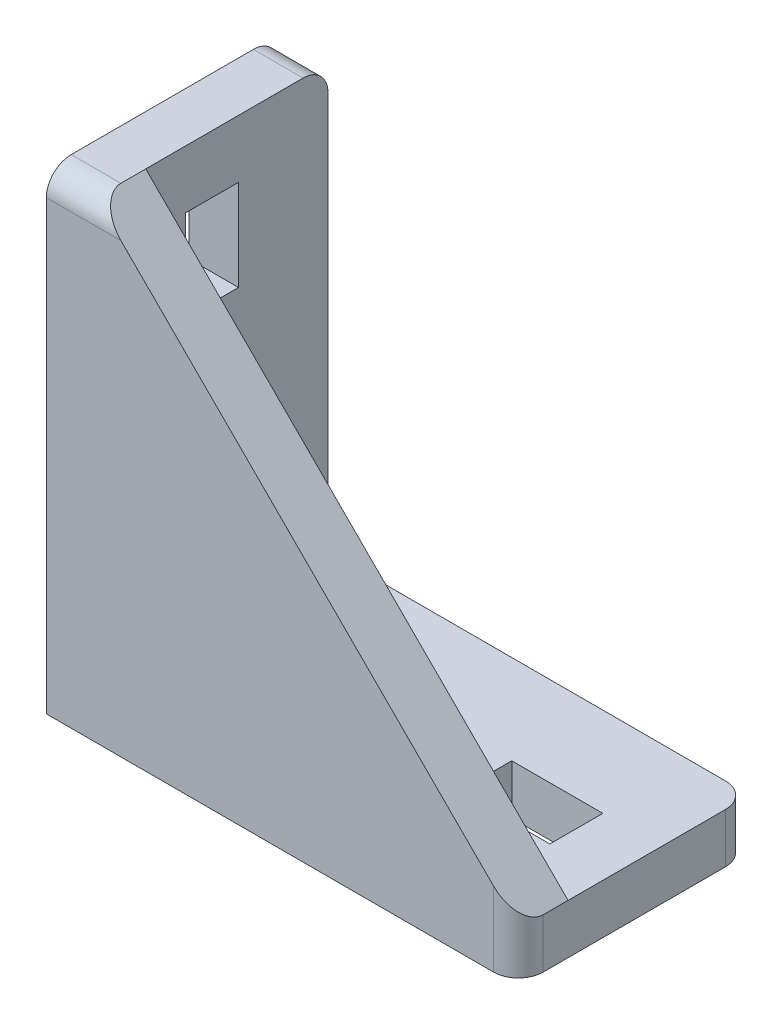
ISO-10303-21;
HEADER;
FILE_DESCRIPTION(('STEP AP214'),'2;1');
FILE_NAME('part.step','',(''),(''),'','','');
FILE_SCHEMA(('AUTOMOTIVE_DESIGN { 1 0 10303 214 1 1 1 1 }'));
ENDSEC;
DATA;
#1=APPLICATION_CONTEXT('core data for automotive mechanical design processes');
#2=APPLICATION_PROTOCOL_DEFINITION('international standard','automotive_design',2000,#1);
#3=PRODUCT_CONTEXT('',#1,'mechanical');
#4=PRODUCT('Part','Part','',(#3));
#5=PRODUCT_RELATED_PRODUCT_CATEGORY('part','',(#4));
#6=PRODUCT_DEFINITION_FORMATION('','',#4);
#7=PRODUCT_DEFINITION_CONTEXT('part definition',#1,'design');
#8=PRODUCT_DEFINITION('design','',#6,#7);
#9=PRODUCT_DEFINITION_SHAPE('','',#8);
#10=(LENGTH_UNIT() NAMED_UNIT(*) SI_UNIT(.MILLI.,.METRE.));
#11=(NAMED_UNIT(*) PLANE_ANGLE_UNIT() SI_UNIT($,.RADIAN.));
#12=(NAMED_UNIT(*) SI_UNIT($,.STERADIAN.) SOLID_ANGLE_UNIT());
#13=UNCERTAINTY_MEASURE_WITH_UNIT(LENGTH_MEASURE(1.E-05),#10,'distance_accuracy_value','');
#14=(GEOMETRIC_REPRESENTATION_CONTEXT(3) GLOBAL_UNCERTAINTY_ASSIGNED_CONTEXT((#13)) GLOBAL_UNIT_ASSIGNED_CONTEXT((#10,
#11,#12)) REPRESENTATION_CONTEXT('',''));
#15=CARTESIAN_POINT('',(0.,0.,0.));
#16=DIRECTION('',(0.,0.,1.));
#17=DIRECTION('',(1.,0.,0.));
#18=AXIS2_PLACEMENT_3D('',#15,#16,#17);
#19=CARTESIAN_POINT('',(6.00000000000001,6.,28.));
#20=DIRECTION('',(0.,-1.,0.));
#21=DIRECTION('',(0.,0.,-1.));
#22=AXIS2_PLACEMENT_3D('',#19,#20,#21);
#23=PLANE('',#22);
#24=DIRECTION('',(-1.,0.,0.));
#25=VECTOR('',#24,1.);
#26=CARTESIAN_POINT('',(39.,6.,10.8));
#27=LINE('',#26,#25);
#28=CARTESIAN_POINT('',(50.,6.,10.8));
#29=VERTEX_POINT('',#28);
#30=CARTESIAN_POINT('',(39.,6.,10.8));
#31=VERTEX_POINT('',#30);
#32=EDGE_CURVE('E245',#29,#31,#27,.T.);
#33=ORIENTED_EDGE('',*,*,#32,.F.);
#34=DIRECTION('',(0.,0.,-1.));
#35=VECTOR('',#34,1.);
#36=CARTESIAN_POINT('',(50.,6.,10.8));
#37=LINE('',#36,#35);
#38=CARTESIAN_POINT('',(50.,6.,17.2));
#39=VERTEX_POINT('',#38);
#40=EDGE_CURVE('E218',#39,#29,#37,.T.);
#41=ORIENTED_EDGE('',*,*,#40,.F.);
#42=DIRECTION('',(1.,0.,0.));
#43=VECTOR('',#42,1.);
#44=CARTESIAN_POINT('',(39.,6.,17.2));
#45=LINE('',#44,#43);
#46=CARTESIAN_POINT('',(39.,6.,17.2));
#47=VERTEX_POINT('',#46);
#48=EDGE_CURVE('E236',#47,#39,#45,.T.);
#49=ORIENTED_EDGE('',*,*,#48,.F.);
#50=DIRECTION('',(0.,0.,1.));
#51=VECTOR('',#50,1.);
#52=CARTESIAN_POINT('',(39.,6.,10.8));
#53=LINE('',#52,#51);
#54=EDGE_CURVE('E239',#31,#47,#53,.T.);
#55=ORIENTED_EDGE('',*,*,#54,.F.);
#56=EDGE_LOOP('',(#33,#41,#49,#55));
#57=FACE_BOUND('',#56,.T.);
#58=DIRECTION('',(-1.,0.,0.));
#59=VECTOR('',#58,1.);
#60=CARTESIAN_POINT('',(10.,6.,10.8));
#61=LINE('',#60,#59);
#62=CARTESIAN_POINT('',(20.,6.,10.8));
#63=VERTEX_POINT('',#62);
#64=CARTESIAN_POINT('',(10.,6.,10.8));
#65=VERTEX_POINT('',#64);
#66=EDGE_CURVE('E272',#63,#65,#61,.T.);
#67=ORIENTED_EDGE('',*,*,#66,.F.);
#68=DIRECTION('',(0.,0.,-1.));
#69=VECTOR('',#68,1.);
#70=CARTESIAN_POINT('',(20.,6.,10.8));
#71=LINE('',#70,#69);
#72=CARTESIAN_POINT('',(20.,6.,17.2));
#73=VERTEX_POINT('',#72);
#74=EDGE_CURVE('E270',#73,#63,#71,.T.);
#75=ORIENTED_EDGE('',*,*,#74,.F.);
#76=DIRECTION('',(1.,0.,0.));
#77=VECTOR('',#76,1.);
#78=CARTESIAN_POINT('',(10.,6.,17.2));
#79=LINE('',#78,#77);
#80=CARTESIAN_POINT('',(10.,6.,17.2));
#81=VERTEX_POINT('',#80);
#82=EDGE_CURVE('E260',#81,#73,#79,.T.);
#83=ORIENTED_EDGE('',*,*,#82,.F.);
#84=DIRECTION('',(0.,0.,1.));
#85=VECTOR('',#84,1.);
#86=CARTESIAN_POINT('',(10.,6.,10.8));
#87=LINE('',#86,#85);
#88=EDGE_CURVE('E275',#65,#81,#87,.T.);
#89=ORIENTED_EDGE('',*,*,#88,.F.);
#90=EDGE_LOOP('',(#67,#75,#83,#89));
#91=FACE_BOUND('',#90,.T.);
#92=DIRECTION('',(0.,0.,-1.));
#93=VECTOR('',#92,1.);
#94=CARTESIAN_POINT('',(57.,6.,28.));
#95=LINE('',#94,#93);
#96=CARTESIAN_POINT('',(57.,6.,22.));
#97=VERTEX_POINT('',#96);
#98=CARTESIAN_POINT('',(57.,6.,3.));
#99=VERTEX_POINT('',#98);
#100=EDGE_CURVE('E388',#97,#99,#95,.T.);
#101=ORIENTED_EDGE('',*,*,#100,.T.);
#102=CARTESIAN_POINT('',(54.,6.,3.));
#103=DIRECTION('',(0.,-1.,0.));
#104=DIRECTION('',(0.,0.,-1.));
#105=AXIS2_PLACEMENT_3D('',#102,#103,#104);
#106=CIRCLE('',#105,3.);
#107=CARTESIAN_POINT('',(54.,6.,0.));
#108=VERTEX_POINT('',#107);
#109=EDGE_CURVE('E11',#99,#108,#106,.F.);
#110=ORIENTED_EDGE('',*,*,#109,.T.);
#111=DIRECTION('',(-1.,0.,0.));
#112=VECTOR('',#111,1.);
#113=CARTESIAN_POINT('',(6.00000000000001,6.,0.));
#114=LINE('',#113,#112);
#115=CARTESIAN_POINT('',(6.00000000000001,6.,0.));
#116=VERTEX_POINT('',#115);
#117=EDGE_CURVE('E372',#108,#116,#114,.T.);
#118=ORIENTED_EDGE('',*,*,#117,.T.);
#119=DIRECTION('',(0.,0.,-1.));
#120=VECTOR('',#119,1.);
#121=CARTESIAN_POINT('',(6.00000000000001,6.,28.));
#122=LINE('',#121,#120);
#123=CARTESIAN_POINT('',(6.00000000000001,6.,22.));
#124=VERTEX_POINT('',#123);
#125=EDGE_CURVE('E385',#124,#116,#122,.T.);
#126=ORIENTED_EDGE('',*,*,#125,.F.);
#127=DIRECTION('',(1.,0.,0.));
#128=VECTOR('',#127,1.);
#129=CARTESIAN_POINT('',(6.00000000000001,6.,22.));
#130=LINE('',#129,#128);
#131=EDGE_CURVE('E357',#124,#97,#130,.T.);
#132=ORIENTED_EDGE('',*,*,#131,.T.);
#133=EDGE_LOOP('',(#101,#110,#118,#126,#132));
#134=FACE_BOUND('',#133,.T.);
#135=ADVANCED_FACE('F32',(#57,#91,#134),#23,.F.);
#136=CARTESIAN_POINT('',(6.,57.,28.));
#137=DIRECTION('',(-1.,0.,0.));
#138=DIRECTION('',(0.,-1.,0.));
#139=AXIS2_PLACEMENT_3D('',#136,#137,#138);
#140=PLANE('',#139);
#141=DIRECTION('',(0.,0.,1.));
#142=VECTOR('',#141,1.);
#143=CARTESIAN_POINT('',(6.,50.,17.2));
#144=LINE('',#143,#142);
#145=CARTESIAN_POINT('',(6.,50.,10.8));
#146=VERTEX_POINT('',#145);
#147=CARTESIAN_POINT('',(6.,50.,17.2));
#148=VERTEX_POINT('',#147);
#149=EDGE_CURVE('E303',#146,#148,#144,.T.);
#150=ORIENTED_EDGE('',*,*,#149,.F.);
#151=DIRECTION('',(0.,1.,0.));
#152=VECTOR('',#151,1.);
#153=CARTESIAN_POINT('',(6.,39.,10.8));
#154=LINE('',#153,#152);
#155=CARTESIAN_POINT('',(6.,39.,10.8));
#156=VERTEX_POINT('',#155);
#157=EDGE_CURVE('E301',#156,#146,#154,.T.);
#158=ORIENTED_EDGE('',*,*,#157,.F.);
#159=DIRECTION('',(0.,0.,-1.));
#160=VECTOR('',#159,1.);
#161=CARTESIAN_POINT('',(6.,39.,17.2));
#162=LINE('',#161,#160);
#163=CARTESIAN_POINT('',(6.,39.,17.2));
#164=VERTEX_POINT('',#163);
#165=EDGE_CURVE('E291',#164,#156,#162,.T.);
#166=ORIENTED_EDGE('',*,*,#165,.F.);
#167=DIRECTION('',(0.,-1.,0.));
#168=VECTOR('',#167,1.);
#169=CARTESIAN_POINT('',(6.,39.,17.2));
#170=LINE('',#169,#168);
#171=EDGE_CURVE('E307',#148,#164,#170,.T.);
#172=ORIENTED_EDGE('',*,*,#171,.F.);
#173=EDGE_LOOP('',(#150,#158,#166,#172));
#174=FACE_BOUND('',#173,.T.);
#175=DIRECTION('',(0.,0.,1.));
#176=VECTOR('',#175,1.);
#177=CARTESIAN_POINT('',(6.,20.,17.2));
#178=LINE('',#177,#176);
#179=CARTESIAN_POINT('',(6.,20.,10.8));
#180=VERTEX_POINT('',#179);
#181=CARTESIAN_POINT('',(6.,20.,17.2));
#182=VERTEX_POINT('',#181);
#183=EDGE_CURVE('E336',#180,#182,#178,.T.);
#184=ORIENTED_EDGE('',*,*,#183,.F.);
#185=DIRECTION('',(0.,1.,0.));
#186=VECTOR('',#185,1.);
#187=CARTESIAN_POINT('',(6.00000000000001,9.99999999999999,10.8));
#188=LINE('',#187,#186);
#189=CARTESIAN_POINT('',(6.00000000000001,9.99999999999999,10.8));
#190=VERTEX_POINT('',#189);
#191=EDGE_CURVE('E252',#190,#180,#188,.T.);
#192=ORIENTED_EDGE('',*,*,#191,.F.);
#193=DIRECTION('',(0.,0.,-1.));
#194=VECTOR('',#193,1.);
#195=CARTESIAN_POINT('',(6.00000000000001,9.99999999999999,17.2));
#196=LINE('',#195,#194);
#197=CARTESIAN_POINT('',(6.00000000000001,9.99999999999999,17.2));
#198=VERTEX_POINT('',#197);
#199=EDGE_CURVE('E325',#198,#190,#196,.T.);
#200=ORIENTED_EDGE('',*,*,#199,.F.);
#201=DIRECTION('',(0.,-1.,0.));
#202=VECTOR('',#201,1.);
#203=CARTESIAN_POINT('',(6.00000000000001,9.99999999999999,17.2));
#204=LINE('',#203,#202);
#205=EDGE_CURVE('E339',#182,#198,#204,.T.);
#206=ORIENTED_EDGE('',*,*,#205,.F.);
#207=EDGE_LOOP('',(#184,#192,#200,#206));
#208=FACE_BOUND('',#207,.T.);
#209=DIRECTION('',(0.,1.,0.));
#210=VECTOR('',#209,1.);
#211=CARTESIAN_POINT('',(6.,57.,0.));
#212=LINE('',#211,#210);
#213=CARTESIAN_POINT('',(6.,54.,0.));
#214=VERTEX_POINT('',#213);
#215=EDGE_CURVE('E374',#116,#214,#212,.T.);
#216=ORIENTED_EDGE('',*,*,#215,.T.);
#217=CARTESIAN_POINT('',(6.,54.,3.));
#218=DIRECTION('',(-1.,0.,0.));
#219=DIRECTION('',(0.,-1.,0.));
#220=AXIS2_PLACEMENT_3D('',#217,#218,#219);
#221=CIRCLE('',#220,3.);
#222=CARTESIAN_POINT('',(6.,57.,3.));
#223=VERTEX_POINT('',#222);
#224=EDGE_CURVE('E40',#214,#223,#221,.F.);
#225=ORIENTED_EDGE('',*,*,#224,.T.);
#226=DIRECTION('',(0.,0.,-1.));
#227=VECTOR('',#226,1.);
#228=CARTESIAN_POINT('',(6.,57.,28.));
#229=LINE('',#228,#227);
#230=CARTESIAN_POINT('',(6.,57.,22.));
#231=VERTEX_POINT('',#230);
#232=EDGE_CURVE('E382',#231,#223,#229,.T.);
#233=ORIENTED_EDGE('',*,*,#232,.F.);
#234=DIRECTION('',(0.,-1.,0.));
#235=VECTOR('',#234,1.);
#236=CARTESIAN_POINT('',(6.,57.,22.));
#237=LINE('',#236,#235);
#238=EDGE_CURVE('E354',#231,#124,#237,.T.);
#239=ORIENTED_EDGE('',*,*,#238,.T.);
#240=ORIENTED_EDGE('',*,*,#125,.T.);
#241=EDGE_LOOP('',(#216,#225,#233,#239,#240));
#242=FACE_BOUND('',#241,.T.);
#243=ADVANCED_FACE('F428',(#174,#208,#242),#140,.F.);
#244=CARTESIAN_POINT('',(57.,0.,28.));
#245=DIRECTION('',(0.,1.,0.));
#246=DIRECTION('',(0.,0.,1.));
#247=AXIS2_PLACEMENT_3D('',#244,#245,#246);
#248=PLANE('',#247);
#249=DIRECTION('',(1.,0.,0.));
#250=VECTOR('',#249,1.);
#251=CARTESIAN_POINT('',(39.,0.,17.2));
#252=LINE('',#251,#250);
#253=CARTESIAN_POINT('',(39.,0.,17.2));
#254=VERTEX_POINT('',#253);
#255=CARTESIAN_POINT('',(50.,0.,17.2));
#256=VERTEX_POINT('',#255);
#257=EDGE_CURVE('E223',#254,#256,#252,.T.);
#258=ORIENTED_EDGE('',*,*,#257,.T.);
#259=DIRECTION('',(0.,0.,-1.));
#260=VECTOR('',#259,1.);
#261=CARTESIAN_POINT('',(50.,0.,10.8));
#262=LINE('',#261,#260);
#263=CARTESIAN_POINT('',(50.,0.,10.8));
#264=VERTEX_POINT('',#263);
#265=EDGE_CURVE('E215',#256,#264,#262,.T.);
#266=ORIENTED_EDGE('',*,*,#265,.T.);
#267=DIRECTION('',(-1.,0.,0.));
#268=VECTOR('',#267,1.);
#269=CARTESIAN_POINT('',(39.,0.,10.8));
#270=LINE('',#269,#268);
#271=CARTESIAN_POINT('',(39.,0.,10.8));
#272=VERTEX_POINT('',#271);
#273=EDGE_CURVE('E227',#264,#272,#270,.T.);
#274=ORIENTED_EDGE('',*,*,#273,.T.);
#275=DIRECTION('',(0.,0.,1.));
#276=VECTOR('',#275,1.);
#277=CARTESIAN_POINT('',(39.,0.,10.8));
#278=LINE('',#277,#276);
#279=EDGE_CURVE('E231',#272,#254,#278,.T.);
#280=ORIENTED_EDGE('',*,*,#279,.T.);
#281=EDGE_LOOP('',(#258,#266,#274,#280));
#282=FACE_BOUND('',#281,.T.);
#283=DIRECTION('',(1.,0.,0.));
#284=VECTOR('',#283,1.);
#285=CARTESIAN_POINT('',(10.,0.,17.2));
#286=LINE('',#285,#284);
#287=CARTESIAN_POINT('',(10.,0.,17.2));
#288=VERTEX_POINT('',#287);
#289=CARTESIAN_POINT('',(20.,0.,17.2));
#290=VERTEX_POINT('',#289);
#291=EDGE_CURVE('E266',#288,#290,#286,.T.);
#292=ORIENTED_EDGE('',*,*,#291,.T.);
#293=DIRECTION('',(0.,0.,-1.));
#294=VECTOR('',#293,1.);
#295=CARTESIAN_POINT('',(20.,0.,10.8));
#296=LINE('',#295,#294);
#297=CARTESIAN_POINT('',(20.,0.,10.8));
#298=VERTEX_POINT('',#297);
#299=EDGE_CURVE('E256',#290,#298,#296,.T.);
#300=ORIENTED_EDGE('',*,*,#299,.T.);
#301=DIRECTION('',(-1.,0.,0.));
#302=VECTOR('',#301,1.);
#303=CARTESIAN_POINT('',(10.,0.,10.8));
#304=LINE('',#303,#302);
#305=CARTESIAN_POINT('',(10.,0.,10.8));
#306=VERTEX_POINT('',#305);
#307=EDGE_CURVE('E259',#298,#306,#304,.T.);
#308=ORIENTED_EDGE('',*,*,#307,.T.);
#309=DIRECTION('',(0.,0.,1.));
#310=VECTOR('',#309,1.);
#311=CARTESIAN_POINT('',(10.,0.,10.8));
#312=LINE('',#311,#310);
#313=EDGE_CURVE('E263',#306,#288,#312,.T.);
#314=ORIENTED_EDGE('',*,*,#313,.T.);
#315=EDGE_LOOP('',(#292,#300,#308,#314));
#316=FACE_BOUND('',#315,.T.);
#317=DIRECTION('',(0.,0.,-1.));
#318=VECTOR('',#317,1.);
#319=CARTESIAN_POINT('',(57.,0.,28.));
#320=LINE('',#319,#318);
#321=CARTESIAN_POINT('',(57.,0.,25.));
#322=VERTEX_POINT('',#321);
#323=CARTESIAN_POINT('',(57.,0.,3.));
#324=VERTEX_POINT('',#323);
#325=EDGE_CURVE('E391',#322,#324,#320,.T.);
#326=ORIENTED_EDGE('',*,*,#325,.F.);
#327=CARTESIAN_POINT('',(54.,0.,25.));
#328=DIRECTION('',(0.,1.,0.));
#329=DIRECTION('',(0.,0.,1.));
#330=AXIS2_PLACEMENT_3D('',#327,#328,#329);
#331=CIRCLE('',#330,3.);
#332=CARTESIAN_POINT('',(54.,0.,28.));
#333=VERTEX_POINT('',#332);
#334=EDGE_CURVE('E411',#322,#333,#331,.F.);
#335=ORIENTED_EDGE('',*,*,#334,.T.);
#336=DIRECTION('',(1.,0.,0.));
#337=VECTOR('',#336,1.);
#338=CARTESIAN_POINT('',(57.,0.,28.));
#339=LINE('',#338,#337);
#340=CARTESIAN_POINT('',(0.,0.,28.));
#341=VERTEX_POINT('',#340);
#342=EDGE_CURVE('E363',#341,#333,#339,.T.);
#343=ORIENTED_EDGE('',*,*,#342,.F.);
#344=DIRECTION('',(0.,0.,-1.));
#345=VECTOR('',#344,1.);
#346=CARTESIAN_POINT('',(0.,0.,28.));
#347=LINE('',#346,#345);
#348=CARTESIAN_POINT('',(0.,0.,0.));
#349=VERTEX_POINT('',#348);
#350=EDGE_CURVE('E369',#341,#349,#347,.T.);
#351=ORIENTED_EDGE('',*,*,#350,.T.);
#352=DIRECTION('',(1.,0.,0.));
#353=VECTOR('',#352,1.);
#354=CARTESIAN_POINT('',(57.,0.,0.));
#355=LINE('',#354,#353);
#356=CARTESIAN_POINT('',(54.,0.,0.));
#357=VERTEX_POINT('',#356);
#358=EDGE_CURVE('E360',#349,#357,#355,.T.);
#359=ORIENTED_EDGE('',*,*,#358,.T.);
#360=CARTESIAN_POINT('',(54.,0.,3.));
#361=DIRECTION('',(0.,1.,0.));
#362=DIRECTION('',(0.,0.,1.));
#363=AXIS2_PLACEMENT_3D('',#360,#361,#362);
#364=CIRCLE('',#363,3.);
#365=EDGE_CURVE('E409',#357,#324,#364,.F.);
#366=ORIENTED_EDGE('',*,*,#365,.T.);
#367=EDGE_LOOP('',(#326,#335,#343,#351,#359,#366));
#368=FACE_BOUND('',#367,.T.);
#369=ADVANCED_FACE('F233',(#282,#316,#368),#248,.F.);
#370=CARTESIAN_POINT('',(57.,6.,28.));
#371=DIRECTION('',(-1.,0.,0.));
#372=DIRECTION('',(0.,-1.,0.));
#373=AXIS2_PLACEMENT_3D('',#370,#371,#372);
#374=PLANE('',#373);
#375=CARTESIAN_POINT('',(57.,6.,25.));
#376=VERTEX_POINT('',#375);
#377=EDGE_CURVE('E389',#376,#97,#95,.T.);
#378=ORIENTED_EDGE('',*,*,#377,.F.);
#379=DIRECTION('',(0.,1.,0.));
#380=VECTOR('',#379,1.);
#381=CARTESIAN_POINT('',(57.,6.,25.));
#382=LINE('',#381,#380);
#383=EDGE_CURVE('E407',#376,#322,#382,.F.);
#384=ORIENTED_EDGE('',*,*,#383,.T.);
#385=ORIENTED_EDGE('',*,*,#325,.T.);
#386=DIRECTION('',(0.,1.,0.));
#387=VECTOR('',#386,1.);
#388=CARTESIAN_POINT('',(57.,6.,3.));
#389=LINE('',#388,#387);
#390=EDGE_CURVE('E404',#324,#99,#389,.T.);
#391=ORIENTED_EDGE('',*,*,#390,.T.);
#392=ORIENTED_EDGE('',*,*,#100,.F.);
#393=EDGE_LOOP('',(#378,#384,#385,#391,#392));
#394=FACE_BOUND('',#393,.T.);
#395=ADVANCED_FACE('F453',(#394),#374,.F.);
#396=CARTESIAN_POINT('',(0.,57.,28.));
#397=DIRECTION('',(0.,-1.,0.));
#398=DIRECTION('',(0.,0.,-1.));
#399=AXIS2_PLACEMENT_3D('',#396,#397,#398);
#400=PLANE('',#399);
#401=DIRECTION('',(0.,0.,-1.));
#402=VECTOR('',#401,1.);
#403=CARTESIAN_POINT('',(0.,57.,28.));
#404=LINE('',#403,#402);
#405=CARTESIAN_POINT('',(0.,57.,25.));
#406=VERTEX_POINT('',#405);
#407=CARTESIAN_POINT('',(0.,57.,3.));
#408=VERTEX_POINT('',#407);
#409=EDGE_CURVE('E379',#406,#408,#404,.T.);
#410=ORIENTED_EDGE('',*,*,#409,.F.);
#411=DIRECTION('',(-1.,0.,0.));
#412=VECTOR('',#411,1.);
#413=CARTESIAN_POINT('',(0.,57.,25.));
#414=LINE('',#413,#412);
#415=CARTESIAN_POINT('',(6.,57.,25.));
#416=VERTEX_POINT('',#415);
#417=EDGE_CURVE('E420',#406,#416,#414,.F.);
#418=ORIENTED_EDGE('',*,*,#417,.T.);
#419=EDGE_CURVE('E383',#416,#231,#229,.T.);
#420=ORIENTED_EDGE('',*,*,#419,.T.);
#421=ORIENTED_EDGE('',*,*,#232,.T.);
#422=DIRECTION('',(-1.,0.,0.));
#423=VECTOR('',#422,1.);
#424=CARTESIAN_POINT('',(0.,57.,3.));
#425=LINE('',#424,#423);
#426=EDGE_CURVE('E417',#223,#408,#425,.T.);
#427=ORIENTED_EDGE('',*,*,#426,.T.);
#428=EDGE_LOOP('',(#410,#418,#420,#421,#427));
#429=FACE_BOUND('',#428,.T.);
#430=ADVANCED_FACE('F433',(#429),#400,.F.);
#431=CARTESIAN_POINT('',(0.,0.,28.));
#432=DIRECTION('',(1.,0.,0.));
#433=DIRECTION('',(0.,0.,-1.));
#434=AXIS2_PLACEMENT_3D('',#431,#432,#433);
#435=PLANE('',#434);
#436=DIRECTION('',(0.,0.,-1.));
#437=VECTOR('',#436,1.);
#438=CARTESIAN_POINT('',(0.,39.,17.2));
#439=LINE('',#438,#437);
#440=CARTESIAN_POINT('',(0.,39.,17.2));
#441=VERTEX_POINT('',#440);
#442=CARTESIAN_POINT('',(0.,39.,10.8));
#443=VERTEX_POINT('',#442);
#444=EDGE_CURVE('E297',#441,#443,#439,.T.);
#445=ORIENTED_EDGE('',*,*,#444,.T.);
#446=DIRECTION('',(0.,1.,0.));
#447=VECTOR('',#446,1.);
#448=CARTESIAN_POINT('',(0.,39.,10.8));
#449=LINE('',#448,#447);
#450=CARTESIAN_POINT('',(0.,50.,10.8));
#451=VERTEX_POINT('',#450);
#452=EDGE_CURVE('E287',#443,#451,#449,.T.);
#453=ORIENTED_EDGE('',*,*,#452,.T.);
#454=DIRECTION('',(0.,0.,1.));
#455=VECTOR('',#454,1.);
#456=CARTESIAN_POINT('',(0.,50.,17.2));
#457=LINE('',#456,#455);
#458=CARTESIAN_POINT('',(0.,50.,17.2));
#459=VERTEX_POINT('',#458);
#460=EDGE_CURVE('E290',#451,#459,#457,.T.);
#461=ORIENTED_EDGE('',*,*,#460,.T.);
#462=DIRECTION('',(0.,-1.,0.));
#463=VECTOR('',#462,1.);
#464=CARTESIAN_POINT('',(0.,39.,17.2));
#465=LINE('',#464,#463);
#466=EDGE_CURVE('E294',#459,#441,#465,.T.);
#467=ORIENTED_EDGE('',*,*,#466,.T.);
#468=EDGE_LOOP('',(#445,#453,#461,#467));
#469=FACE_BOUND('',#468,.T.);
#470=DIRECTION('',(0.,0.,-1.));
#471=VECTOR('',#470,1.);
#472=CARTESIAN_POINT('',(0.,9.99999999999999,17.2));
#473=LINE('',#472,#471);
#474=CARTESIAN_POINT('',(0.,9.99999999999999,17.2));
#475=VERTEX_POINT('',#474);
#476=CARTESIAN_POINT('',(0.,9.99999999999999,10.8));
#477=VERTEX_POINT('',#476);
#478=EDGE_CURVE('E331',#475,#477,#473,.T.);
#479=ORIENTED_EDGE('',*,*,#478,.T.);
#480=DIRECTION('',(0.,1.,0.));
#481=VECTOR('',#480,1.);
#482=CARTESIAN_POINT('',(0.,9.99999999999999,10.8));
#483=LINE('',#482,#481);
#484=CARTESIAN_POINT('',(0.,20.,10.8));
#485=VERTEX_POINT('',#484);
#486=EDGE_CURVE('E321',#477,#485,#483,.T.);
#487=ORIENTED_EDGE('',*,*,#486,.T.);
#488=DIRECTION('',(0.,0.,1.));
#489=VECTOR('',#488,1.);
#490=CARTESIAN_POINT('',(0.,20.,17.2));
#491=LINE('',#490,#489);
#492=CARTESIAN_POINT('',(0.,20.,17.2));
#493=VERTEX_POINT('',#492);
#494=EDGE_CURVE('E324',#485,#493,#491,.T.);
#495=ORIENTED_EDGE('',*,*,#494,.T.);
#496=DIRECTION('',(0.,-1.,0.));
#497=VECTOR('',#496,1.);
#498=CARTESIAN_POINT('',(0.,9.99999999999999,17.2));
#499=LINE('',#498,#497);
#500=EDGE_CURVE('E328',#493,#475,#499,.T.);
#501=ORIENTED_EDGE('',*,*,#500,.T.);
#502=EDGE_LOOP('',(#479,#487,#495,#501));
#503=FACE_BOUND('',#502,.T.);
#504=DIRECTION('',(0.,-1.,0.));
#505=VECTOR('',#504,1.);
#506=CARTESIAN_POINT('',(0.,0.,28.));
#507=LINE('',#506,#505);
#508=CARTESIAN_POINT('',(0.,54.,28.));
#509=VERTEX_POINT('',#508);
#510=EDGE_CURVE('E366',#509,#341,#507,.T.);
#511=ORIENTED_EDGE('',*,*,#510,.F.);
#512=CARTESIAN_POINT('',(0.,54.,25.));
#513=DIRECTION('',(1.,0.,0.));
#514=DIRECTION('',(0.,0.,-1.));
#515=AXIS2_PLACEMENT_3D('',#512,#513,#514);
#516=CIRCLE('',#515,3.);
#517=EDGE_CURVE('E415',#509,#406,#516,.F.);
#518=ORIENTED_EDGE('',*,*,#517,.T.);
#519=ORIENTED_EDGE('',*,*,#409,.T.);
#520=CARTESIAN_POINT('',(0.,54.,3.));
#521=DIRECTION('',(1.,0.,0.));
#522=DIRECTION('',(0.,0.,-1.));
#523=AXIS2_PLACEMENT_3D('',#520,#521,#522);
#524=CIRCLE('',#523,3.);
#525=CARTESIAN_POINT('',(0.,54.,0.));
#526=VERTEX_POINT('',#525);
#527=EDGE_CURVE('E413',#408,#526,#524,.F.);
#528=ORIENTED_EDGE('',*,*,#527,.T.);
#529=DIRECTION('',(0.,-1.,0.));
#530=VECTOR('',#529,1.);
#531=CARTESIAN_POINT('',(0.,0.,0.));
#532=LINE('',#531,#530);
#533=EDGE_CURVE('E367',#526,#349,#532,.T.);
#534=ORIENTED_EDGE('',*,*,#533,.T.);
#535=ORIENTED_EDGE('',*,*,#350,.F.);
#536=EDGE_LOOP('',(#511,#518,#519,#528,#534,#535));
#537=FACE_BOUND('',#536,.T.);
#538=ADVANCED_FACE('F439',(#469,#503,#537),#435,.F.);
#539=CARTESIAN_POINT('',(0.,0.,28.));
#540=DIRECTION('',(0.,0.,-1.));
#541=DIRECTION('',(-1.,0.,0.));
#542=AXIS2_PLACEMENT_3D('',#539,#540,#541);
#543=PLANE('',#542);
#544=ORIENTED_EDGE('',*,*,#342,.T.);
#545=DIRECTION('',(0.,1.,0.));
#546=VECTOR('',#545,1.);
#547=CARTESIAN_POINT('',(54.,0.,28.));
#548=LINE('',#547,#546);
#549=CARTESIAN_POINT('',(54.,9.,28.));
#550=VERTEX_POINT('',#549);
#551=EDGE_CURVE('E397',#333,#550,#548,.T.);
#552=ORIENTED_EDGE('',*,*,#551,.T.);
#553=DIRECTION('',(-0.707106781186548,0.707106781186547,0.));
#554=VECTOR('',#553,1.);
#555=CARTESIAN_POINT('',(57.,6.,28.));
#556=LINE('',#555,#554);
#557=CARTESIAN_POINT('',(9.,54.,28.));
#558=VERTEX_POINT('',#557);
#559=EDGE_CURVE('E314',#550,#558,#556,.T.);
#560=ORIENTED_EDGE('',*,*,#559,.T.);
#561=DIRECTION('',(-1.,0.,0.));
#562=VECTOR('',#561,1.);
#563=CARTESIAN_POINT('',(0.,54.,28.));
#564=LINE('',#563,#562);
#565=EDGE_CURVE('E394',#558,#509,#564,.T.);
#566=ORIENTED_EDGE('',*,*,#565,.T.);
#567=ORIENTED_EDGE('',*,*,#510,.T.);
#568=EDGE_LOOP('',(#544,#552,#560,#566,#567));
#569=FACE_BOUND('',#568,.T.);
#570=ADVANCED_FACE('F468',(#569),#543,.F.);
#571=CARTESIAN_POINT('',(0.,0.,0.));
#572=DIRECTION('',(0.,0.,-1.));
#573=DIRECTION('',(-1.,0.,0.));
#574=AXIS2_PLACEMENT_3D('',#571,#572,#573);
#575=PLANE('',#574);
#576=ORIENTED_EDGE('',*,*,#533,.F.);
#577=DIRECTION('',(-1.,0.,0.));
#578=VECTOR('',#577,1.);
#579=CARTESIAN_POINT('',(6.,54.,0.));
#580=LINE('',#579,#578);
#581=EDGE_CURVE('E53',#526,#214,#580,.F.);
#582=ORIENTED_EDGE('',*,*,#581,.T.);
#583=ORIENTED_EDGE('',*,*,#215,.F.);
#584=ORIENTED_EDGE('',*,*,#117,.F.);
#585=DIRECTION('',(0.,1.,0.));
#586=VECTOR('',#585,1.);
#587=CARTESIAN_POINT('',(54.,0.,0.));
#588=LINE('',#587,#586);
#589=EDGE_CURVE('E422',#108,#357,#588,.F.);
#590=ORIENTED_EDGE('',*,*,#589,.T.);
#591=ORIENTED_EDGE('',*,*,#358,.F.);
#592=EDGE_LOOP('',(#576,#582,#583,#584,#590,#591));
#593=FACE_BOUND('',#592,.T.);
#594=ADVANCED_FACE('F442',(#593),#575,.T.);
#595=CARTESIAN_POINT('',(57.,6.,22.));
#596=DIRECTION('',(0.707106781186547,0.707106781186548,0.));
#597=DIRECTION('',(-0.707106781186548,0.707106781186547,0.));
#598=AXIS2_PLACEMENT_3D('',#595,#596,#597);
#599=PLANE('',#598);
#600=ORIENTED_EDGE('',*,*,#559,.F.);
#601=CARTESIAN_POINT('',(54.,9.,25.));
#602=DIRECTION('',(0.707106781186547,0.707106781186548,0.));
#603=DIRECTION('',(-0.707106781186548,0.707106781186547,0.));
#604=AXIS2_PLACEMENT_3D('',#601,#602,#603);
#605=ELLIPSE('',#604,4.24264068711928,3.);
#606=EDGE_CURVE('E402',#550,#376,#605,.T.);
#607=ORIENTED_EDGE('',*,*,#606,.T.);
#608=ORIENTED_EDGE('',*,*,#377,.T.);
#609=DIRECTION('',(-0.707106781186548,0.707106781186547,0.));
#610=VECTOR('',#609,1.);
#611=CARTESIAN_POINT('',(57.,6.,22.));
#612=LINE('',#611,#610);
#613=EDGE_CURVE('E351',#97,#231,#612,.T.);
#614=ORIENTED_EDGE('',*,*,#613,.T.);
#615=ORIENTED_EDGE('',*,*,#419,.F.);
#616=CARTESIAN_POINT('',(9.,54.,25.));
#617=DIRECTION('',(0.707106781186547,0.707106781186548,0.));
#618=DIRECTION('',(-0.707106781186548,0.707106781186547,0.));
#619=AXIS2_PLACEMENT_3D('',#616,#617,#618);
#620=ELLIPSE('',#619,4.24264068711929,3.);
#621=EDGE_CURVE('E400',#416,#558,#620,.T.);
#622=ORIENTED_EDGE('',*,*,#621,.T.);
#623=EDGE_LOOP('',(#600,#607,#608,#614,#615,#622));
#624=FACE_BOUND('',#623,.T.);
#625=ADVANCED_FACE('F460',(#624),#599,.T.);
#626=CARTESIAN_POINT('',(0.,0.,22.));
#627=DIRECTION('',(0.,0.,1.));
#628=DIRECTION('',(1.,0.,0.));
#629=AXIS2_PLACEMENT_3D('',#626,#627,#628);
#630=PLANE('',#629);
#631=ORIENTED_EDGE('',*,*,#613,.F.);
#632=ORIENTED_EDGE('',*,*,#131,.F.);
#633=ORIENTED_EDGE('',*,*,#238,.F.);
#634=EDGE_LOOP('',(#631,#632,#633));
#635=FACE_BOUND('',#634,.T.);
#636=ADVANCED_FACE('F457',(#635),#630,.F.);
#637=CARTESIAN_POINT('',(0.,9.99999999999999,10.8));
#638=DIRECTION('',(0.,0.,-1.));
#639=DIRECTION('',(-1.,0.,0.));
#640=AXIS2_PLACEMENT_3D('',#637,#638,#639);
#641=PLANE('',#640);
#642=ORIENTED_EDGE('',*,*,#191,.T.);
#643=DIRECTION('',(1.,0.,0.));
#644=VECTOR('',#643,1.);
#645=CARTESIAN_POINT('',(0.,20.,10.8));
#646=LINE('',#645,#644);
#647=EDGE_CURVE('E334',#485,#180,#646,.T.);
#648=ORIENTED_EDGE('',*,*,#647,.F.);
#649=ORIENTED_EDGE('',*,*,#486,.F.);
#650=DIRECTION('',(1.,0.,0.));
#651=VECTOR('',#650,1.);
#652=CARTESIAN_POINT('',(0.,9.99999999999999,10.8));
#653=LINE('',#652,#651);
#654=EDGE_CURVE('E304',#477,#190,#653,.T.);
#655=ORIENTED_EDGE('',*,*,#654,.T.);
#656=EDGE_LOOP('',(#642,#648,#649,#655));
#657=FACE_BOUND('',#656,.T.);
#658=ADVANCED_FACE('F539',(#657),#641,.F.);
#659=CARTESIAN_POINT('',(0.,9.99999999999999,17.2));
#660=DIRECTION('',(0.,-1.,0.));
#661=DIRECTION('',(1.,0.,0.));
#662=AXIS2_PLACEMENT_3D('',#659,#660,#661);
#663=PLANE('',#662);
#664=ORIENTED_EDGE('',*,*,#199,.T.);
#665=ORIENTED_EDGE('',*,*,#654,.F.);
#666=ORIENTED_EDGE('',*,*,#478,.F.);
#667=DIRECTION('',(1.,0.,0.));
#668=VECTOR('',#667,1.);
#669=CARTESIAN_POINT('',(0.,9.99999999999999,17.2));
#670=LINE('',#669,#668);
#671=EDGE_CURVE('E345',#475,#198,#670,.T.);
#672=ORIENTED_EDGE('',*,*,#671,.T.);
#673=EDGE_LOOP('',(#664,#665,#666,#672));
#674=FACE_BOUND('',#673,.T.);
#675=ADVANCED_FACE('F546',(#674),#663,.F.);
#676=CARTESIAN_POINT('',(0.,9.99999999999999,17.2));
#677=DIRECTION('',(0.,0.,1.));
#678=DIRECTION('',(1.,0.,0.));
#679=AXIS2_PLACEMENT_3D('',#676,#677,#678);
#680=PLANE('',#679);
#681=ORIENTED_EDGE('',*,*,#205,.T.);
#682=ORIENTED_EDGE('',*,*,#671,.F.);
#683=ORIENTED_EDGE('',*,*,#500,.F.);
#684=DIRECTION('',(1.,0.,0.));
#685=VECTOR('',#684,1.);
#686=CARTESIAN_POINT('',(0.,20.,17.2));
#687=LINE('',#686,#685);
#688=EDGE_CURVE('E347',#493,#182,#687,.T.);
#689=ORIENTED_EDGE('',*,*,#688,.T.);
#690=EDGE_LOOP('',(#681,#682,#683,#689));
#691=FACE_BOUND('',#690,.T.);
#692=ADVANCED_FACE('F554',(#691),#680,.F.);
#693=CARTESIAN_POINT('',(0.,20.,17.2));
#694=DIRECTION('',(0.,1.,0.));
#695=DIRECTION('',(0.,0.,1.));
#696=AXIS2_PLACEMENT_3D('',#693,#694,#695);
#697=PLANE('',#696);
#698=ORIENTED_EDGE('',*,*,#183,.T.);
#699=ORIENTED_EDGE('',*,*,#688,.F.);
#700=ORIENTED_EDGE('',*,*,#494,.F.);
#701=ORIENTED_EDGE('',*,*,#647,.T.);
#702=EDGE_LOOP('',(#698,#699,#700,#701));
#703=FACE_BOUND('',#702,.T.);
#704=ADVANCED_FACE('F562',(#703),#697,.F.);
#705=CARTESIAN_POINT('',(0.,39.,10.8));
#706=DIRECTION('',(0.,0.,-1.));
#707=DIRECTION('',(-1.,0.,0.));
#708=AXIS2_PLACEMENT_3D('',#705,#706,#707);
#709=PLANE('',#708);
#710=ORIENTED_EDGE('',*,*,#157,.T.);
#711=DIRECTION('',(1.,0.,0.));
#712=VECTOR('',#711,1.);
#713=CARTESIAN_POINT('',(0.,50.,10.8));
#714=LINE('',#713,#712);
#715=EDGE_CURVE('E300',#451,#146,#714,.T.);
#716=ORIENTED_EDGE('',*,*,#715,.F.);
#717=ORIENTED_EDGE('',*,*,#452,.F.);
#718=DIRECTION('',(1.,0.,0.));
#719=VECTOR('',#718,1.);
#720=CARTESIAN_POINT('',(0.,39.,10.8));
#721=LINE('',#720,#719);
#722=EDGE_CURVE('E312',#443,#156,#721,.T.);
#723=ORIENTED_EDGE('',*,*,#722,.T.);
#724=EDGE_LOOP('',(#710,#716,#717,#723));
#725=FACE_BOUND('',#724,.T.);
#726=ADVANCED_FACE('F570',(#725),#709,.F.);
#727=CARTESIAN_POINT('',(0.,39.,17.2));
#728=DIRECTION('',(0.,-1.,0.));
#729=DIRECTION('',(1.,0.,0.));
#730=AXIS2_PLACEMENT_3D('',#727,#728,#729);
#731=PLANE('',#730);
#732=ORIENTED_EDGE('',*,*,#165,.T.);
#733=ORIENTED_EDGE('',*,*,#722,.F.);
#734=ORIENTED_EDGE('',*,*,#444,.F.);
#735=DIRECTION('',(1.,0.,0.));
#736=VECTOR('',#735,1.);
#737=CARTESIAN_POINT('',(0.,39.,17.2));
#738=LINE('',#737,#736);
#739=EDGE_CURVE('E315',#441,#164,#738,.T.);
#740=ORIENTED_EDGE('',*,*,#739,.T.);
#741=EDGE_LOOP('',(#732,#733,#734,#740));
#742=FACE_BOUND('',#741,.T.);
#743=ADVANCED_FACE('F578',(#742),#731,.F.);
#744=CARTESIAN_POINT('',(0.,39.,17.2));
#745=DIRECTION('',(0.,0.,1.));
#746=DIRECTION('',(1.,0.,0.));
#747=AXIS2_PLACEMENT_3D('',#744,#745,#746);
#748=PLANE('',#747);
#749=ORIENTED_EDGE('',*,*,#171,.T.);
#750=ORIENTED_EDGE('',*,*,#739,.F.);
#751=ORIENTED_EDGE('',*,*,#466,.F.);
#752=DIRECTION('',(1.,0.,0.));
#753=VECTOR('',#752,1.);
#754=CARTESIAN_POINT('',(0.,50.,17.2));
#755=LINE('',#754,#753);
#756=EDGE_CURVE('E317',#459,#148,#755,.T.);
#757=ORIENTED_EDGE('',*,*,#756,.T.);
#758=EDGE_LOOP('',(#749,#750,#751,#757));
#759=FACE_BOUND('',#758,.T.);
#760=ADVANCED_FACE('F586',(#759),#748,.F.);
#761=CARTESIAN_POINT('',(0.,50.,17.2));
#762=DIRECTION('',(0.,1.,0.));
#763=DIRECTION('',(-1.,0.,0.));
#764=AXIS2_PLACEMENT_3D('',#761,#762,#763);
#765=PLANE('',#764);
#766=ORIENTED_EDGE('',*,*,#149,.T.);
#767=ORIENTED_EDGE('',*,*,#756,.F.);
#768=ORIENTED_EDGE('',*,*,#460,.F.);
#769=ORIENTED_EDGE('',*,*,#715,.T.);
#770=EDGE_LOOP('',(#766,#767,#768,#769));
#771=FACE_BOUND('',#770,.T.);
#772=ADVANCED_FACE('F594',(#771),#765,.F.);
#773=CARTESIAN_POINT('',(20.,0.,10.8));
#774=DIRECTION('',(1.,0.,0.));
#775=DIRECTION('',(0.,0.,-1.));
#776=AXIS2_PLACEMENT_3D('',#773,#774,#775);
#777=PLANE('',#776);
#778=ORIENTED_EDGE('',*,*,#74,.T.);
#779=DIRECTION('',(0.,1.,0.));
#780=VECTOR('',#779,1.);
#781=CARTESIAN_POINT('',(20.,0.,10.8));
#782=LINE('',#781,#780);
#783=EDGE_CURVE('E269',#298,#63,#782,.T.);
#784=ORIENTED_EDGE('',*,*,#783,.F.);
#785=ORIENTED_EDGE('',*,*,#299,.F.);
#786=DIRECTION('',(0.,1.,0.));
#787=VECTOR('',#786,1.);
#788=CARTESIAN_POINT('',(20.,0.,17.2));
#789=LINE('',#788,#787);
#790=EDGE_CURVE('E246',#290,#73,#789,.T.);
#791=ORIENTED_EDGE('',*,*,#790,.T.);
#792=EDGE_LOOP('',(#778,#784,#785,#791));
#793=FACE_BOUND('',#792,.T.);
#794=ADVANCED_FACE('F602',(#793),#777,.F.);
#795=CARTESIAN_POINT('',(10.,0.,17.2));
#796=DIRECTION('',(0.,0.,1.));
#797=DIRECTION('',(1.,0.,0.));
#798=AXIS2_PLACEMENT_3D('',#795,#796,#797);
#799=PLANE('',#798);
#800=ORIENTED_EDGE('',*,*,#82,.T.);
#801=ORIENTED_EDGE('',*,*,#790,.F.);
#802=ORIENTED_EDGE('',*,*,#291,.F.);
#803=DIRECTION('',(0.,1.,0.));
#804=VECTOR('',#803,1.);
#805=CARTESIAN_POINT('',(10.,0.,17.2));
#806=LINE('',#805,#804);
#807=EDGE_CURVE('E281',#288,#81,#806,.T.);
#808=ORIENTED_EDGE('',*,*,#807,.T.);
#809=EDGE_LOOP('',(#800,#801,#802,#808));
#810=FACE_BOUND('',#809,.T.);
#811=ADVANCED_FACE('F610',(#810),#799,.F.);
#812=CARTESIAN_POINT('',(10.,0.,10.8));
#813=DIRECTION('',(-1.,0.,0.));
#814=DIRECTION('',(0.,0.,1.));
#815=AXIS2_PLACEMENT_3D('',#812,#813,#814);
#816=PLANE('',#815);
#817=ORIENTED_EDGE('',*,*,#88,.T.);
#818=ORIENTED_EDGE('',*,*,#807,.F.);
#819=ORIENTED_EDGE('',*,*,#313,.F.);
#820=DIRECTION('',(0.,1.,0.));
#821=VECTOR('',#820,1.);
#822=CARTESIAN_POINT('',(10.,0.,10.8));
#823=LINE('',#822,#821);
#824=EDGE_CURVE('E283',#306,#65,#823,.T.);
#825=ORIENTED_EDGE('',*,*,#824,.T.);
#826=EDGE_LOOP('',(#817,#818,#819,#825));
#827=FACE_BOUND('',#826,.T.);
#828=ADVANCED_FACE('F618',(#827),#816,.F.);
#829=CARTESIAN_POINT('',(10.,0.,10.8));
#830=DIRECTION('',(0.,0.,-1.));
#831=DIRECTION('',(-1.,0.,0.));
#832=AXIS2_PLACEMENT_3D('',#829,#830,#831);
#833=PLANE('',#832);
#834=ORIENTED_EDGE('',*,*,#66,.T.);
#835=ORIENTED_EDGE('',*,*,#824,.F.);
#836=ORIENTED_EDGE('',*,*,#307,.F.);
#837=ORIENTED_EDGE('',*,*,#783,.T.);
#838=EDGE_LOOP('',(#834,#835,#836,#837));
#839=FACE_BOUND('',#838,.T.);
#840=ADVANCED_FACE('F626',(#839),#833,.F.);
#841=CARTESIAN_POINT('',(50.,0.,10.8));
#842=DIRECTION('',(1.,0.,0.));
#843=DIRECTION('',(0.,0.,-1.));
#844=AXIS2_PLACEMENT_3D('',#841,#842,#843);
#845=PLANE('',#844);
#846=ORIENTED_EDGE('',*,*,#40,.T.);
#847=DIRECTION('',(0.,1.,0.));
#848=VECTOR('',#847,1.);
#849=CARTESIAN_POINT('',(50.,0.,10.8));
#850=LINE('',#849,#848);
#851=EDGE_CURVE('E211',#264,#29,#850,.T.);
#852=ORIENTED_EDGE('',*,*,#851,.F.);
#853=ORIENTED_EDGE('',*,*,#265,.F.);
#854=DIRECTION('',(0.,1.,0.));
#855=VECTOR('',#854,1.);
#856=CARTESIAN_POINT('',(50.,0.,17.2));
#857=LINE('',#856,#855);
#858=EDGE_CURVE('E250',#256,#39,#857,.T.);
#859=ORIENTED_EDGE('',*,*,#858,.T.);
#860=EDGE_LOOP('',(#846,#852,#853,#859));
#861=FACE_BOUND('',#860,.T.);
#862=ADVANCED_FACE('F213',(#861),#845,.F.);
#863=CARTESIAN_POINT('',(39.,0.,17.2));
#864=DIRECTION('',(0.,0.,1.));
#865=DIRECTION('',(1.,0.,0.));
#866=AXIS2_PLACEMENT_3D('',#863,#864,#865);
#867=PLANE('',#866);
#868=ORIENTED_EDGE('',*,*,#48,.T.);
#869=ORIENTED_EDGE('',*,*,#858,.F.);
#870=ORIENTED_EDGE('',*,*,#257,.F.);
#871=DIRECTION('',(0.,1.,0.));
#872=VECTOR('',#871,1.);
#873=CARTESIAN_POINT('',(39.,0.,17.2));
#874=LINE('',#873,#872);
#875=EDGE_CURVE('E253',#254,#47,#874,.T.);
#876=ORIENTED_EDGE('',*,*,#875,.T.);
#877=EDGE_LOOP('',(#868,#869,#870,#876));
#878=FACE_BOUND('',#877,.T.);
#879=ADVANCED_FACE('F641',(#878),#867,.F.);
#880=CARTESIAN_POINT('',(39.,0.,10.8));
#881=DIRECTION('',(-1.,0.,0.));
#882=DIRECTION('',(0.,0.,1.));
#883=AXIS2_PLACEMENT_3D('',#880,#881,#882);
#884=PLANE('',#883);
#885=ORIENTED_EDGE('',*,*,#54,.T.);
#886=ORIENTED_EDGE('',*,*,#875,.F.);
#887=ORIENTED_EDGE('',*,*,#279,.F.);
#888=DIRECTION('',(0.,1.,0.));
#889=VECTOR('',#888,1.);
#890=CARTESIAN_POINT('',(39.,0.,10.8));
#891=LINE('',#890,#889);
#892=EDGE_CURVE('E222',#272,#31,#891,.T.);
#893=ORIENTED_EDGE('',*,*,#892,.T.);
#894=EDGE_LOOP('',(#885,#886,#887,#893));
#895=FACE_BOUND('',#894,.T.);
#896=ADVANCED_FACE('F648',(#895),#884,.F.);
#897=CARTESIAN_POINT('',(39.,0.,10.8));
#898=DIRECTION('',(0.,0.,-1.));
#899=DIRECTION('',(-1.,0.,0.));
#900=AXIS2_PLACEMENT_3D('',#897,#898,#899);
#901=PLANE('',#900);
#902=ORIENTED_EDGE('',*,*,#32,.T.);
#903=ORIENTED_EDGE('',*,*,#892,.F.);
#904=ORIENTED_EDGE('',*,*,#273,.F.);
#905=ORIENTED_EDGE('',*,*,#851,.T.);
#906=EDGE_LOOP('',(#902,#903,#904,#905));
#907=FACE_BOUND('',#906,.T.);
#908=ADVANCED_FACE('F228',(#907),#901,.F.);
#909=CARTESIAN_POINT('',(54.,0.,25.));
#910=DIRECTION('',(0.,1.,0.));
#911=DIRECTION('',(-1.,0.,0.));
#912=AXIS2_PLACEMENT_3D('',#909,#910,#911);
#913=CYLINDRICAL_SURFACE('',#912,3.);
#914=ORIENTED_EDGE('',*,*,#334,.F.);
#915=ORIENTED_EDGE('',*,*,#383,.F.);
#916=ORIENTED_EDGE('',*,*,#606,.F.);
#917=ORIENTED_EDGE('',*,*,#551,.F.);
#918=EDGE_LOOP('',(#914,#915,#916,#917));
#919=FACE_BOUND('',#918,.T.);
#920=ADVANCED_FACE('F465',(#919),#913,.T.);
#921=CARTESIAN_POINT('',(0.,54.,25.));
#922=DIRECTION('',(-1.,0.,0.));
#923=DIRECTION('',(0.,0.,1.));
#924=AXIS2_PLACEMENT_3D('',#921,#922,#923);
#925=CYLINDRICAL_SURFACE('',#924,3.);
#926=ORIENTED_EDGE('',*,*,#621,.F.);
#927=ORIENTED_EDGE('',*,*,#417,.F.);
#928=ORIENTED_EDGE('',*,*,#517,.F.);
#929=ORIENTED_EDGE('',*,*,#565,.F.);
#930=EDGE_LOOP('',(#926,#927,#928,#929));
#931=FACE_BOUND('',#930,.T.);
#932=ADVANCED_FACE('F472',(#931),#925,.T.);
#933=CARTESIAN_POINT('',(0.,54.,3.));
#934=DIRECTION('',(1.,0.,0.));
#935=DIRECTION('',(0.,0.,-1.));
#936=AXIS2_PLACEMENT_3D('',#933,#934,#935);
#937=CYLINDRICAL_SURFACE('',#936,3.);
#938=ORIENTED_EDGE('',*,*,#224,.F.);
#939=ORIENTED_EDGE('',*,*,#581,.F.);
#940=ORIENTED_EDGE('',*,*,#527,.F.);
#941=ORIENTED_EDGE('',*,*,#426,.F.);
#942=EDGE_LOOP('',(#938,#939,#940,#941));
#943=FACE_BOUND('',#942,.T.);
#944=ADVANCED_FACE('F436',(#943),#937,.T.);
#945=CARTESIAN_POINT('',(54.,6.,3.));
#946=DIRECTION('',(0.,-1.,0.));
#947=DIRECTION('',(1.,0.,0.));
#948=AXIS2_PLACEMENT_3D('',#945,#946,#947);
#949=CYLINDRICAL_SURFACE('',#948,3.);
#950=ORIENTED_EDGE('',*,*,#365,.F.);
#951=ORIENTED_EDGE('',*,*,#589,.F.);
#952=ORIENTED_EDGE('',*,*,#109,.F.);
#953=ORIENTED_EDGE('',*,*,#390,.F.);
#954=EDGE_LOOP('',(#950,#951,#952,#953));
#955=FACE_BOUND('',#954,.T.);
#956=ADVANCED_FACE('F34',(#955),#949,.T.);
#957=CLOSED_SHELL('',(#135,#243,#369,#395,#430,#538,#570,#594,#625,#636,#658,#675,#692,#704,
#726,#743,#760,#772,#794,#811,#828,#840,#862,#879,#896,#908,#920,#932,#944,#956));
#958=MANIFOLD_SOLID_BREP('B2',#957);
#959=ADVANCED_BREP_SHAPE_REPRESENTATION('',(#18,#958),#14);
#960=SHAPE_DEFINITION_REPRESENTATION(#9,#959);
ENDSEC;
END-ISO-10303-21;
